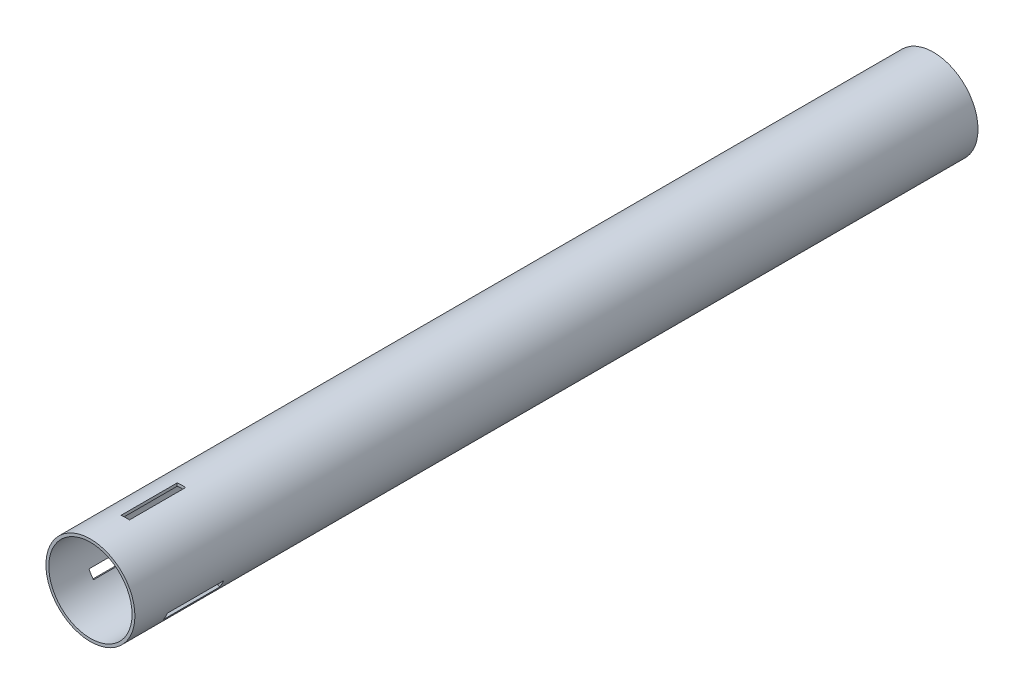
ISO-10303-21;
HEADER;
FILE_DESCRIPTION(('STEP AP214'),'2;1');
FILE_NAME('part.step','',(''),(''),'','','');
FILE_SCHEMA(('AUTOMOTIVE_DESIGN { 1 0 10303 214 1 1 1 1 }'));
ENDSEC;
DATA;
#1=APPLICATION_CONTEXT('core data for automotive mechanical design processes');
#2=APPLICATION_PROTOCOL_DEFINITION('international standard','automotive_design',2000,#1);
#3=PRODUCT_CONTEXT('',#1,'mechanical');
#4=PRODUCT('Part','Part','',(#3));
#5=PRODUCT_RELATED_PRODUCT_CATEGORY('part','',(#4));
#6=PRODUCT_DEFINITION_FORMATION('','',#4);
#7=PRODUCT_DEFINITION_CONTEXT('part definition',#1,'design');
#8=PRODUCT_DEFINITION('design','',#6,#7);
#9=PRODUCT_DEFINITION_SHAPE('','',#8);
#10=(LENGTH_UNIT() NAMED_UNIT(*) SI_UNIT(.MILLI.,.METRE.));
#11=(NAMED_UNIT(*) PLANE_ANGLE_UNIT() SI_UNIT($,.RADIAN.));
#12=(NAMED_UNIT(*) SI_UNIT($,.STERADIAN.) SOLID_ANGLE_UNIT());
#13=UNCERTAINTY_MEASURE_WITH_UNIT(LENGTH_MEASURE(1.E-05),#10,'distance_accuracy_value','');
#14=(GEOMETRIC_REPRESENTATION_CONTEXT(3) GLOBAL_UNCERTAINTY_ASSIGNED_CONTEXT((#13)) GLOBAL_UNIT_ASSIGNED_CONTEXT((#10,
#11,#12)) REPRESENTATION_CONTEXT('',''));
#15=CARTESIAN_POINT('',(0.,0.,0.));
#16=DIRECTION('',(0.,0.,1.));
#17=DIRECTION('',(1.,0.,0.));
#18=AXIS2_PLACEMENT_3D('',#15,#16,#17);
#19=CARTESIAN_POINT('',(0.,0.,450.));
#20=DIRECTION('',(0.,0.,1.));
#21=DIRECTION('',(1.,0.,0.));
#22=AXIS2_PLACEMENT_3D('',#19,#20,#21);
#23=PLANE('',#22);
#24=CARTESIAN_POINT('',(0.,0.,450.));
#25=DIRECTION('',(0.,0.,1.));
#26=DIRECTION('',(1.,0.,0.));
#27=AXIS2_PLACEMENT_3D('',#24,#25,#26);
#28=CIRCLE('',#27,23.75);
#29=CARTESIAN_POINT('',(23.75,0.,450.));
#30=VERTEX_POINT('',#29);
#31=EDGE_CURVE('E11',#30,#30,#28,.T.);
#32=ORIENTED_EDGE('',*,*,#31,.T.);
#33=EDGE_LOOP('',(#32));
#34=FACE_BOUND('',#33,.T.);
#35=CARTESIAN_POINT('',(0.,0.,450.));
#36=DIRECTION('',(0.,0.,1.));
#37=DIRECTION('',(1.,0.,0.));
#38=AXIS2_PLACEMENT_3D('',#35,#36,#37);
#39=CIRCLE('',#38,22.225);
#40=CARTESIAN_POINT('',(22.225,0.,450.));
#41=VERTEX_POINT('',#40);
#42=EDGE_CURVE('E225',#41,#41,#39,.T.);
#43=ORIENTED_EDGE('',*,*,#42,.F.);
#44=EDGE_LOOP('',(#43));
#45=FACE_BOUND('',#44,.T.);
#46=ADVANCED_FACE('F33',(#34,#45),#23,.T.);
#47=CARTESIAN_POINT('',(0.,0.,0.));
#48=DIRECTION('',(0.,0.,1.));
#49=DIRECTION('',(1.,0.,0.));
#50=AXIS2_PLACEMENT_3D('',#47,#48,#49);
#51=PLANE('',#50);
#52=CARTESIAN_POINT('',(0.,0.,0.));
#53=DIRECTION('',(0.,0.,1.));
#54=DIRECTION('',(1.,0.,0.));
#55=AXIS2_PLACEMENT_3D('',#52,#53,#54);
#56=CIRCLE('',#55,23.75);
#57=CARTESIAN_POINT('',(23.75,0.,0.));
#58=VERTEX_POINT('',#57);
#59=EDGE_CURVE('E37',#58,#58,#56,.T.);
#60=ORIENTED_EDGE('',*,*,#59,.F.);
#61=EDGE_LOOP('',(#60));
#62=FACE_BOUND('',#61,.T.);
#63=CARTESIAN_POINT('',(0.,0.,0.));
#64=DIRECTION('',(0.,0.,1.));
#65=DIRECTION('',(1.,0.,0.));
#66=AXIS2_PLACEMENT_3D('',#63,#64,#65);
#67=CIRCLE('',#66,22.225);
#68=CARTESIAN_POINT('',(22.225,0.,0.));
#69=VERTEX_POINT('',#68);
#70=EDGE_CURVE('E224',#69,#69,#67,.T.);
#71=ORIENTED_EDGE('',*,*,#70,.T.);
#72=EDGE_LOOP('',(#71));
#73=FACE_BOUND('',#72,.T.);
#74=ADVANCED_FACE('F231',(#62,#73),#51,.F.);
#75=CARTESIAN_POINT('',(0.,0.,450.));
#76=DIRECTION('',(0.,0.,-1.));
#77=DIRECTION('',(-1.,0.,0.));
#78=AXIS2_PLACEMENT_3D('',#75,#76,#77);
#79=CYLINDRICAL_SURFACE('',#78,23.75);
#80=CARTESIAN_POINT('',(0.,0.,400.756532699597));
#81=DIRECTION('',(0.,0.,-1.));
#82=DIRECTION('',(-1.,0.,0.));
#83=AXIS2_PLACEMENT_3D('',#80,#81,#82);
#84=CIRCLE('',#83,23.75);
#85=CARTESIAN_POINT('',(-21.3158541273184,-10.4736270137371,400.756532699597));
#86=VERTEX_POINT('',#85);
#87=CARTESIAN_POINT('',(-18.9388685136238,-14.3311464797366,400.756532699597));
#88=VERTEX_POINT('',#87);
#89=EDGE_CURVE('E138',#86,#88,#84,.F.);
#90=ORIENTED_EDGE('',*,*,#89,.F.);
#91=DIRECTION('',(0.,0.,-1.));
#92=VECTOR('',#91,1.);
#93=CARTESIAN_POINT('',(-21.3158541273184,-10.4736270137371,450.));
#94=LINE('',#93,#92);
#95=CARTESIAN_POINT('',(-21.3158541273184,-10.4736270137371,430.756532699597));
#96=VERTEX_POINT('',#95);
#97=EDGE_CURVE('E163',#96,#86,#94,.T.);
#98=ORIENTED_EDGE('',*,*,#97,.F.);
#99=CARTESIAN_POINT('',(0.,0.,430.756532699597));
#100=DIRECTION('',(0.,0.,1.));
#101=DIRECTION('',(1.,0.,0.));
#102=AXIS2_PLACEMENT_3D('',#99,#100,#101);
#103=CIRCLE('',#102,23.75);
#104=CARTESIAN_POINT('',(-18.9388685136238,-14.3311464797366,430.756532699597));
#105=VERTEX_POINT('',#104);
#106=EDGE_CURVE('E155',#105,#96,#103,.F.);
#107=ORIENTED_EDGE('',*,*,#106,.F.);
#108=DIRECTION('',(0.,0.,-1.));
#109=VECTOR('',#108,1.);
#110=CARTESIAN_POINT('',(-18.9388685136238,-14.3311464797366,450.));
#111=LINE('',#110,#109);
#112=EDGE_CURVE('E48',#88,#105,#111,.F.);
#113=ORIENTED_EDGE('',*,*,#112,.F.);
#114=EDGE_LOOP('',(#90,#98,#107,#113));
#115=FACE_BOUND('',#114,.T.);
#116=CARTESIAN_POINT('',(0.,0.,400.756532699597));
#117=DIRECTION('',(0.,0.,-1.));
#118=DIRECTION('',(-1.,0.,0.));
#119=AXIS2_PLACEMENT_3D('',#116,#117,#118);
#120=CIRCLE('',#119,23.75);
#121=CARTESIAN_POINT('',(19.7283541273186,-13.2232576707524,400.756532699597));
#122=VERTEX_POINT('',#121);
#123=CARTESIAN_POINT('',(21.8805711736198,-9.23596801186306,400.756532699597));
#124=VERTEX_POINT('',#123);
#125=EDGE_CURVE('E176',#122,#124,#120,.F.);
#126=ORIENTED_EDGE('',*,*,#125,.F.);
#127=DIRECTION('',(0.,0.,-1.));
#128=VECTOR('',#127,1.);
#129=CARTESIAN_POINT('',(19.7283541273186,-13.2232576707524,450.));
#130=LINE('',#129,#128);
#131=CARTESIAN_POINT('',(19.7283541273185,-13.2232576707524,430.756532699597));
#132=VERTEX_POINT('',#131);
#133=EDGE_CURVE('E146',#132,#122,#130,.T.);
#134=ORIENTED_EDGE('',*,*,#133,.F.);
#135=CARTESIAN_POINT('',(0.,0.,430.756532699597));
#136=DIRECTION('',(0.,0.,1.));
#137=DIRECTION('',(1.,0.,0.));
#138=AXIS2_PLACEMENT_3D('',#135,#136,#137);
#139=CIRCLE('',#138,23.75);
#140=CARTESIAN_POINT('',(21.8805711736198,-9.23596801186306,430.756532699597));
#141=VERTEX_POINT('',#140);
#142=EDGE_CURVE('E180',#141,#132,#139,.F.);
#143=ORIENTED_EDGE('',*,*,#142,.F.);
#144=DIRECTION('',(0.,0.,-1.));
#145=VECTOR('',#144,1.);
#146=CARTESIAN_POINT('',(21.8805711736198,-9.23596801186306,450.));
#147=LINE('',#146,#145);
#148=EDGE_CURVE('E56',#124,#141,#147,.F.);
#149=ORIENTED_EDGE('',*,*,#148,.F.);
#150=EDGE_LOOP('',(#126,#134,#143,#149));
#151=FACE_BOUND('',#150,.T.);
#152=CARTESIAN_POINT('',(0.,0.,400.756532699597));
#153=DIRECTION('',(0.,0.,-1.));
#154=DIRECTION('',(-1.,0.,0.));
#155=AXIS2_PLACEMENT_3D('',#152,#153,#154);
#156=CIRCLE('',#155,23.75);
#157=CARTESIAN_POINT('',(1.5875,23.6968846844896,400.756532699597));
#158=VERTEX_POINT('',#157);
#159=CARTESIAN_POINT('',(-2.94170265999583,23.5671144915998,400.756532699597));
#160=VERTEX_POINT('',#159);
#161=EDGE_CURVE('E201',#158,#160,#156,.F.);
#162=ORIENTED_EDGE('',*,*,#161,.F.);
#163=DIRECTION('',(0.,0.,-1.));
#164=VECTOR('',#163,1.);
#165=CARTESIAN_POINT('',(1.5875,23.6968846844896,450.));
#166=LINE('',#165,#164);
#167=CARTESIAN_POINT('',(1.5875,23.6968846844896,430.756532699597));
#168=VERTEX_POINT('',#167);
#169=EDGE_CURVE('E221',#168,#158,#166,.T.);
#170=ORIENTED_EDGE('',*,*,#169,.F.);
#171=CARTESIAN_POINT('',(0.,0.,430.756532699597));
#172=DIRECTION('',(0.,0.,1.));
#173=DIRECTION('',(1.,0.,0.));
#174=AXIS2_PLACEMENT_3D('',#171,#172,#173);
#175=CIRCLE('',#174,23.75);
#176=CARTESIAN_POINT('',(-2.94170265999583,23.5671144915998,430.756532699597));
#177=VERTEX_POINT('',#176);
#178=EDGE_CURVE('E206',#177,#168,#175,.F.);
#179=ORIENTED_EDGE('',*,*,#178,.F.);
#180=DIRECTION('',(0.,0.,-1.));
#181=VECTOR('',#180,1.);
#182=CARTESIAN_POINT('',(-2.94170265999583,23.5671144915998,450.));
#183=LINE('',#182,#181);
#184=EDGE_CURVE('E204',#160,#177,#183,.F.);
#185=ORIENTED_EDGE('',*,*,#184,.F.);
#186=EDGE_LOOP('',(#162,#170,#179,#185));
#187=FACE_BOUND('',#186,.T.);
#188=ORIENTED_EDGE('',*,*,#31,.F.);
#189=EDGE_LOOP('',(#188));
#190=FACE_BOUND('',#189,.T.);
#191=ORIENTED_EDGE('',*,*,#59,.T.);
#192=EDGE_LOOP('',(#191));
#193=FACE_BOUND('',#192,.T.);
#194=ADVANCED_FACE('F35',(#115,#151,#187,#190,#193),#79,.T.);
#195=CARTESIAN_POINT('',(0.,0.,450.));
#196=DIRECTION('',(0.,0.,-1.));
#197=DIRECTION('',(-1.,0.,0.));
#198=AXIS2_PLACEMENT_3D('',#195,#196,#197);
#199=CYLINDRICAL_SURFACE('',#198,22.225);
#200=DIRECTION('',(0.,0.,-1.));
#201=VECTOR('',#200,1.);
#202=CARTESIAN_POINT('',(-19.9920012631359,-9.70930020623389,450.));
#203=LINE('',#202,#201);
#204=CARTESIAN_POINT('',(-19.9920012631359,-9.70930020623389,430.756532699597));
#205=VERTEX_POINT('',#204);
#206=CARTESIAN_POINT('',(-19.9920012631359,-9.70930020623391,400.756532699597));
#207=VERTEX_POINT('',#206);
#208=EDGE_CURVE('E145',#205,#207,#203,.T.);
#209=ORIENTED_EDGE('',*,*,#208,.T.);
#210=CARTESIAN_POINT('',(0.,0.,400.756532699597));
#211=DIRECTION('',(0.,0.,-1.));
#212=DIRECTION('',(-1.,0.,0.));
#213=AXIS2_PLACEMENT_3D('',#210,#211,#212);
#214=CIRCLE('',#213,22.225);
#215=CARTESIAN_POINT('',(-17.6072187465357,-13.562318128242,400.756532699597));
#216=VERTEX_POINT('',#215);
#217=EDGE_CURVE('E132',#207,#216,#214,.F.);
#218=ORIENTED_EDGE('',*,*,#217,.T.);
#219=DIRECTION('',(0.,0.,-1.));
#220=VECTOR('',#219,1.);
#221=CARTESIAN_POINT('',(-17.6072187465357,-13.562318128242,450.));
#222=LINE('',#221,#220);
#223=CARTESIAN_POINT('',(-17.6072187465357,-13.562318128242,430.756532699597));
#224=VERTEX_POINT('',#223);
#225=EDGE_CURVE('E122',#216,#224,#222,.F.);
#226=ORIENTED_EDGE('',*,*,#225,.T.);
#227=CARTESIAN_POINT('',(0.,0.,430.756532699597));
#228=DIRECTION('',(0.,0.,1.));
#229=DIRECTION('',(1.,0.,0.));
#230=AXIS2_PLACEMENT_3D('',#227,#228,#229);
#231=CIRCLE('',#230,22.225);
#232=EDGE_CURVE('E131',#224,#205,#231,.F.);
#233=ORIENTED_EDGE('',*,*,#232,.T.);
#234=EDGE_LOOP('',(#209,#218,#226,#233));
#235=FACE_BOUND('',#234,.T.);
#236=DIRECTION('',(0.,0.,-1.));
#237=VECTOR('',#236,1.);
#238=CARTESIAN_POINT('',(18.404501263136,-12.4589308632492,450.));
#239=LINE('',#238,#237);
#240=CARTESIAN_POINT('',(18.404501263136,-12.4589308632492,430.756532699597));
#241=VERTEX_POINT('',#240);
#242=CARTESIAN_POINT('',(18.404501263136,-12.4589308632492,400.756532699597));
#243=VERTEX_POINT('',#242);
#244=EDGE_CURVE('E149',#241,#243,#239,.T.);
#245=ORIENTED_EDGE('',*,*,#244,.T.);
#246=CARTESIAN_POINT('',(0.,0.,400.756532699597));
#247=DIRECTION('',(0.,0.,-1.));
#248=DIRECTION('',(-1.,0.,0.));
#249=AXIS2_PLACEMENT_3D('',#246,#247,#248);
#250=CIRCLE('',#249,22.225);
#251=CARTESIAN_POINT('',(20.5489214065317,-8.46713966036843,400.756532699597));
#252=VERTEX_POINT('',#251);
#253=EDGE_CURVE('E167',#243,#252,#250,.F.);
#254=ORIENTED_EDGE('',*,*,#253,.T.);
#255=DIRECTION('',(0.,0.,-1.));
#256=VECTOR('',#255,1.);
#257=CARTESIAN_POINT('',(20.5489214065317,-8.46713966036843,450.));
#258=LINE('',#257,#256);
#259=CARTESIAN_POINT('',(20.5489214065317,-8.46713966036843,430.756532699597));
#260=VERTEX_POINT('',#259);
#261=EDGE_CURVE('E170',#252,#260,#258,.F.);
#262=ORIENTED_EDGE('',*,*,#261,.T.);
#263=CARTESIAN_POINT('',(0.,0.,430.756532699597));
#264=DIRECTION('',(0.,0.,1.));
#265=DIRECTION('',(1.,0.,0.));
#266=AXIS2_PLACEMENT_3D('',#263,#264,#265);
#267=CIRCLE('',#266,22.225);
#268=EDGE_CURVE('E173',#260,#241,#267,.F.);
#269=ORIENTED_EDGE('',*,*,#268,.T.);
#270=EDGE_LOOP('',(#245,#254,#262,#269));
#271=FACE_BOUND('',#270,.T.);
#272=DIRECTION('',(0.,0.,-1.));
#273=VECTOR('',#272,1.);
#274=CARTESIAN_POINT('',(1.5875,22.1682310694832,450.));
#275=LINE('',#274,#273);
#276=CARTESIAN_POINT('',(1.5875,22.1682310694832,430.756532699597));
#277=VERTEX_POINT('',#276);
#278=CARTESIAN_POINT('',(1.5875,22.1682310694832,400.756532699597));
#279=VERTEX_POINT('',#278);
#280=EDGE_CURVE('E213',#277,#279,#275,.T.);
#281=ORIENTED_EDGE('',*,*,#280,.T.);
#282=CARTESIAN_POINT('',(0.,0.,400.756532699597));
#283=DIRECTION('',(0.,0.,-1.));
#284=DIRECTION('',(-1.,0.,0.));
#285=AXIS2_PLACEMENT_3D('',#282,#283,#284);
#286=CIRCLE('',#285,22.225);
#287=CARTESIAN_POINT('',(-2.94170265999583,22.0294577886105,400.756532699597));
#288=VERTEX_POINT('',#287);
#289=EDGE_CURVE('E166',#279,#288,#286,.F.);
#290=ORIENTED_EDGE('',*,*,#289,.T.);
#291=DIRECTION('',(0.,0.,-1.));
#292=VECTOR('',#291,1.);
#293=CARTESIAN_POINT('',(-2.94170265999583,22.0294577886105,450.));
#294=LINE('',#293,#292);
#295=CARTESIAN_POINT('',(-2.94170265999583,22.0294577886105,430.756532699597));
#296=VERTEX_POINT('',#295);
#297=EDGE_CURVE('E195',#288,#296,#294,.F.);
#298=ORIENTED_EDGE('',*,*,#297,.T.);
#299=CARTESIAN_POINT('',(0.,0.,430.756532699597));
#300=DIRECTION('',(0.,0.,1.));
#301=DIRECTION('',(1.,0.,0.));
#302=AXIS2_PLACEMENT_3D('',#299,#300,#301);
#303=CIRCLE('',#302,22.225);
#304=EDGE_CURVE('E198',#296,#277,#303,.F.);
#305=ORIENTED_EDGE('',*,*,#304,.T.);
#306=EDGE_LOOP('',(#281,#290,#298,#305));
#307=FACE_BOUND('',#306,.T.);
#308=ORIENTED_EDGE('',*,*,#42,.T.);
#309=EDGE_LOOP('',(#308));
#310=FACE_BOUND('',#309,.T.);
#311=ORIENTED_EDGE('',*,*,#70,.F.);
#312=EDGE_LOOP('',(#311));
#313=FACE_BOUND('',#312,.T.);
#314=ADVANCED_FACE('F142',(#235,#271,#307,#310,#313),#199,.F.);
#315=CARTESIAN_POINT('',(1.5875,-23.751,430.756532699597));
#316=DIRECTION('',(1.,0.,0.));
#317=DIRECTION('',(0.,0.,-1.));
#318=AXIS2_PLACEMENT_3D('',#315,#316,#317);
#319=PLANE('',#318);
#320=ORIENTED_EDGE('',*,*,#169,.T.);
#321=DIRECTION('',(0.,1.,0.));
#322=VECTOR('',#321,1.);
#323=CARTESIAN_POINT('',(1.5875,-23.751,400.756532699597));
#324=LINE('',#323,#322);
#325=EDGE_CURVE('E216',#279,#158,#324,.T.);
#326=ORIENTED_EDGE('',*,*,#325,.F.);
#327=ORIENTED_EDGE('',*,*,#280,.F.);
#328=DIRECTION('',(0.,1.,0.));
#329=VECTOR('',#328,1.);
#330=CARTESIAN_POINT('',(1.5875,-23.751,430.756532699597));
#331=LINE('',#330,#329);
#332=EDGE_CURVE('E209',#277,#168,#331,.T.);
#333=ORIENTED_EDGE('',*,*,#332,.T.);
#334=EDGE_LOOP('',(#320,#326,#327,#333));
#335=FACE_BOUND('',#334,.T.);
#336=ADVANCED_FACE('F234',(#335),#319,.F.);
#337=CARTESIAN_POINT('',(-2.94170265999583,-23.751,400.756532699597));
#338=DIRECTION('',(0.,0.,-1.));
#339=DIRECTION('',(-1.,0.,0.));
#340=AXIS2_PLACEMENT_3D('',#337,#338,#339);
#341=PLANE('',#340);
#342=ORIENTED_EDGE('',*,*,#161,.T.);
#343=DIRECTION('',(0.,1.,0.));
#344=VECTOR('',#343,1.);
#345=CARTESIAN_POINT('',(-2.94170265999583,-23.751,400.756532699597));
#346=LINE('',#345,#344);
#347=EDGE_CURVE('E214',#288,#160,#346,.T.);
#348=ORIENTED_EDGE('',*,*,#347,.F.);
#349=ORIENTED_EDGE('',*,*,#289,.F.);
#350=ORIENTED_EDGE('',*,*,#325,.T.);
#351=EDGE_LOOP('',(#342,#348,#349,#350));
#352=FACE_BOUND('',#351,.T.);
#353=ADVANCED_FACE('F240',(#352),#341,.F.);
#354=CARTESIAN_POINT('',(-2.94170265999583,-23.751,430.756532699597));
#355=DIRECTION('',(-1.,0.,0.));
#356=DIRECTION('',(0.,0.,1.));
#357=AXIS2_PLACEMENT_3D('',#354,#355,#356);
#358=PLANE('',#357);
#359=ORIENTED_EDGE('',*,*,#184,.T.);
#360=DIRECTION('',(0.,1.,0.));
#361=VECTOR('',#360,1.);
#362=CARTESIAN_POINT('',(-2.94170265999583,-23.751,430.756532699597));
#363=LINE('',#362,#361);
#364=EDGE_CURVE('E210',#296,#177,#363,.T.);
#365=ORIENTED_EDGE('',*,*,#364,.F.);
#366=ORIENTED_EDGE('',*,*,#297,.F.);
#367=ORIENTED_EDGE('',*,*,#347,.T.);
#368=EDGE_LOOP('',(#359,#365,#366,#367));
#369=FACE_BOUND('',#368,.T.);
#370=ADVANCED_FACE('F358',(#369),#358,.F.);
#371=CARTESIAN_POINT('',(-2.94170265999583,-23.751,430.756532699597));
#372=DIRECTION('',(0.,0.,1.));
#373=DIRECTION('',(1.,0.,0.));
#374=AXIS2_PLACEMENT_3D('',#371,#372,#373);
#375=PLANE('',#374);
#376=ORIENTED_EDGE('',*,*,#178,.T.);
#377=ORIENTED_EDGE('',*,*,#332,.F.);
#378=ORIENTED_EDGE('',*,*,#304,.F.);
#379=ORIENTED_EDGE('',*,*,#364,.T.);
#380=EDGE_LOOP('',(#376,#377,#378,#379));
#381=FACE_BOUND('',#380,.T.);
#382=ADVANCED_FACE('F273',(#381),#375,.F.);
#383=CARTESIAN_POINT('',(-28.8914846826421,14.847419354134,430.756532699597));
#384=DIRECTION('',(-0.499999999999992,-0.866025403784443,0.));
#385=DIRECTION('',(0.866025403784443,-0.499999999999992,0.));
#386=AXIS2_PLACEMENT_3D('',#383,#384,#385);
#387=PLANE('',#386);
#388=ORIENTED_EDGE('',*,*,#133,.T.);
#389=DIRECTION('',(0.866025403784443,-0.499999999999992,0.));
#390=VECTOR('',#389,1.);
#391=CARTESIAN_POINT('',(-28.8914846826421,14.847419354134,400.756532699597));
#392=LINE('',#391,#390);
#393=EDGE_CURVE('E188',#243,#122,#392,.T.);
#394=ORIENTED_EDGE('',*,*,#393,.F.);
#395=ORIENTED_EDGE('',*,*,#244,.F.);
#396=DIRECTION('',(0.866025403784443,-0.499999999999992,0.));
#397=VECTOR('',#396,1.);
#398=CARTESIAN_POINT('',(-28.8914846826421,14.847419354134,430.756532699597));
#399=LINE('',#398,#397);
#400=EDGE_CURVE('E183',#241,#132,#399,.T.);
#401=ORIENTED_EDGE('',*,*,#400,.T.);
#402=EDGE_LOOP('',(#388,#394,#395,#401));
#403=FACE_BOUND('',#402,.T.);
#404=ADVANCED_FACE('F283',(#403),#387,.F.);
#405=CARTESIAN_POINT('',(-26.6268833526443,18.7698239165784,400.756532699597));
#406=DIRECTION('',(0.,0.,-1.));
#407=DIRECTION('',(-1.,0.,0.));
#408=AXIS2_PLACEMENT_3D('',#405,#406,#407);
#409=PLANE('',#408);
#410=ORIENTED_EDGE('',*,*,#125,.T.);
#411=DIRECTION('',(0.866025403784443,-0.499999999999992,0.));
#412=VECTOR('',#411,1.);
#413=CARTESIAN_POINT('',(-26.6268833526443,18.7698239165784,400.756532699597));
#414=LINE('',#413,#412);
#415=EDGE_CURVE('E186',#252,#124,#414,.T.);
#416=ORIENTED_EDGE('',*,*,#415,.F.);
#417=ORIENTED_EDGE('',*,*,#253,.F.);
#418=ORIENTED_EDGE('',*,*,#393,.T.);
#419=EDGE_LOOP('',(#410,#416,#417,#418));
#420=FACE_BOUND('',#419,.T.);
#421=ADVANCED_FACE('F288',(#420),#409,.F.);
#422=CARTESIAN_POINT('',(-26.6268833526443,18.7698239165784,430.756532699597));
#423=DIRECTION('',(0.499999999999992,0.866025403784443,0.));
#424=DIRECTION('',(-0.866025403784443,0.499999999999992,0.));
#425=AXIS2_PLACEMENT_3D('',#422,#423,#424);
#426=PLANE('',#425);
#427=ORIENTED_EDGE('',*,*,#148,.T.);
#428=DIRECTION('',(0.866025403784443,-0.499999999999992,0.));
#429=VECTOR('',#428,1.);
#430=CARTESIAN_POINT('',(-26.6268833526443,18.7698239165784,430.756532699597));
#431=LINE('',#430,#429);
#432=EDGE_CURVE('E184',#260,#141,#431,.T.);
#433=ORIENTED_EDGE('',*,*,#432,.F.);
#434=ORIENTED_EDGE('',*,*,#261,.F.);
#435=ORIENTED_EDGE('',*,*,#415,.T.);
#436=EDGE_LOOP('',(#427,#433,#434,#435));
#437=FACE_BOUND('',#436,.T.);
#438=ADVANCED_FACE('F298',(#437),#426,.F.);
#439=CARTESIAN_POINT('',(-26.6268833526443,18.7698239165784,430.756532699597));
#440=DIRECTION('',(0.,0.,1.));
#441=DIRECTION('',(1.,0.,0.));
#442=AXIS2_PLACEMENT_3D('',#439,#440,#441);
#443=PLANE('',#442);
#444=ORIENTED_EDGE('',*,*,#142,.T.);
#445=ORIENTED_EDGE('',*,*,#400,.F.);
#446=ORIENTED_EDGE('',*,*,#268,.F.);
#447=ORIENTED_EDGE('',*,*,#432,.T.);
#448=EDGE_LOOP('',(#444,#445,#446,#447));
#449=FACE_BOUND('',#448,.T.);
#450=ADVANCED_FACE('F308',(#449),#443,.F.);
#451=CARTESIAN_POINT('',(27.303984682642,17.59705001115,430.756532699597));
#452=DIRECTION('',(-0.500000000000004,0.866025403784436,0.));
#453=DIRECTION('',(-0.866025403784436,-0.500000000000004,0.));
#454=AXIS2_PLACEMENT_3D('',#451,#452,#453);
#455=PLANE('',#454);
#456=ORIENTED_EDGE('',*,*,#97,.T.);
#457=DIRECTION('',(-0.866025403784436,-0.500000000000004,0.));
#458=VECTOR('',#457,1.);
#459=CARTESIAN_POINT('',(27.303984682642,17.59705001115,400.756532699597));
#460=LINE('',#459,#458);
#461=EDGE_CURVE('E139',#207,#86,#460,.T.);
#462=ORIENTED_EDGE('',*,*,#461,.F.);
#463=ORIENTED_EDGE('',*,*,#208,.F.);
#464=DIRECTION('',(-0.866025403784436,-0.500000000000004,0.));
#465=VECTOR('',#464,1.);
#466=CARTESIAN_POINT('',(27.303984682642,17.59705001115,430.756532699597));
#467=LINE('',#466,#465);
#468=EDGE_CURVE('E158',#205,#96,#467,.T.);
#469=ORIENTED_EDGE('',*,*,#468,.T.);
#470=EDGE_LOOP('',(#456,#462,#463,#469));
#471=FACE_BOUND('',#470,.T.);
#472=ADVANCED_FACE('F317',(#471),#455,.F.);
#473=CARTESIAN_POINT('',(29.56858601264,13.6746454487056,400.756532699597));
#474=DIRECTION('',(0.,0.,-1.));
#475=DIRECTION('',(-1.,0.,0.));
#476=AXIS2_PLACEMENT_3D('',#473,#474,#475);
#477=PLANE('',#476);
#478=ORIENTED_EDGE('',*,*,#89,.T.);
#479=DIRECTION('',(-0.866025403784436,-0.500000000000004,0.));
#480=VECTOR('',#479,1.);
#481=CARTESIAN_POINT('',(29.56858601264,13.6746454487056,400.756532699597));
#482=LINE('',#481,#480);
#483=EDGE_CURVE('E125',#216,#88,#482,.T.);
#484=ORIENTED_EDGE('',*,*,#483,.F.);
#485=ORIENTED_EDGE('',*,*,#217,.F.);
#486=ORIENTED_EDGE('',*,*,#461,.T.);
#487=EDGE_LOOP('',(#478,#484,#485,#486));
#488=FACE_BOUND('',#487,.T.);
#489=ADVANCED_FACE('F135',(#488),#477,.F.);
#490=CARTESIAN_POINT('',(29.56858601264,13.6746454487056,430.756532699597));
#491=DIRECTION('',(0.500000000000004,-0.866025403784436,0.));
#492=DIRECTION('',(0.866025403784436,0.500000000000004,0.));
#493=AXIS2_PLACEMENT_3D('',#490,#491,#492);
#494=PLANE('',#493);
#495=ORIENTED_EDGE('',*,*,#112,.T.);
#496=DIRECTION('',(-0.866025403784436,-0.500000000000004,0.));
#497=VECTOR('',#496,1.);
#498=CARTESIAN_POINT('',(29.56858601264,13.6746454487056,430.756532699597));
#499=LINE('',#498,#497);
#500=EDGE_CURVE('E127',#224,#105,#499,.T.);
#501=ORIENTED_EDGE('',*,*,#500,.F.);
#502=ORIENTED_EDGE('',*,*,#225,.F.);
#503=ORIENTED_EDGE('',*,*,#483,.T.);
#504=EDGE_LOOP('',(#495,#501,#502,#503));
#505=FACE_BOUND('',#504,.T.);
#506=ADVANCED_FACE('F124',(#505),#494,.F.);
#507=CARTESIAN_POINT('',(29.56858601264,13.6746454487056,430.756532699597));
#508=DIRECTION('',(0.,0.,1.));
#509=DIRECTION('',(1.,0.,0.));
#510=AXIS2_PLACEMENT_3D('',#507,#508,#509);
#511=PLANE('',#510);
#512=ORIENTED_EDGE('',*,*,#106,.T.);
#513=ORIENTED_EDGE('',*,*,#468,.F.);
#514=ORIENTED_EDGE('',*,*,#232,.F.);
#515=ORIENTED_EDGE('',*,*,#500,.T.);
#516=EDGE_LOOP('',(#512,#513,#514,#515));
#517=FACE_BOUND('',#516,.T.);
#518=ADVANCED_FACE('F344',(#517),#511,.F.);
#519=CLOSED_SHELL('',(#46,#74,#194,#314,#336,#353,#370,#382,#404,#421,#438,#450,#472,#489,#506,#518));
#520=MANIFOLD_SOLID_BREP('B2',#519);
#521=ADVANCED_BREP_SHAPE_REPRESENTATION('',(#18,#520),#14);
#522=SHAPE_DEFINITION_REPRESENTATION(#9,#521);
ENDSEC;
END-ISO-10303-21;
